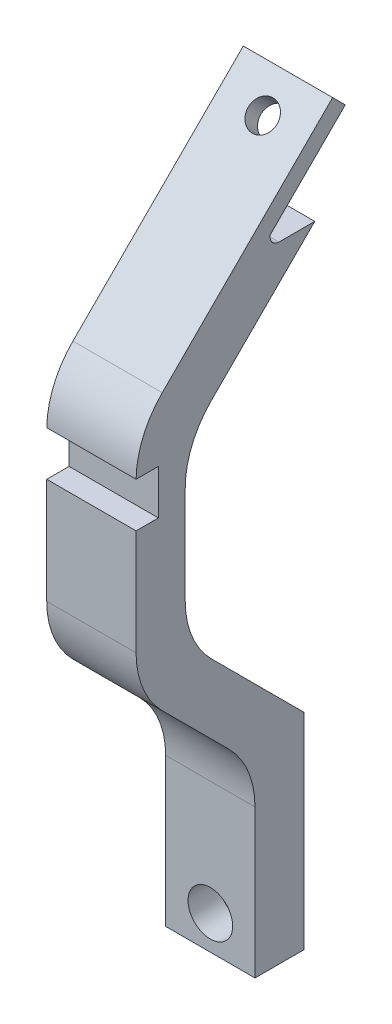
ISO-10303-21;
HEADER;
FILE_DESCRIPTION(('STEP AP214'),'2;1');
FILE_NAME('part.step','',(''),(''),'','','');
FILE_SCHEMA(('AUTOMOTIVE_DESIGN { 1 0 10303 214 1 1 1 1 }'));
ENDSEC;
DATA;
#1=APPLICATION_CONTEXT('core data for automotive mechanical design processes');
#2=APPLICATION_PROTOCOL_DEFINITION('international standard','automotive_design',2000,#1);
#3=PRODUCT_CONTEXT('',#1,'mechanical');
#4=PRODUCT('Part','Part','',(#3));
#5=PRODUCT_RELATED_PRODUCT_CATEGORY('part','',(#4));
#6=PRODUCT_DEFINITION_FORMATION('','',#4);
#7=PRODUCT_DEFINITION_CONTEXT('part definition',#1,'design');
#8=PRODUCT_DEFINITION('design','',#6,#7);
#9=PRODUCT_DEFINITION_SHAPE('','',#8);
#10=(LENGTH_UNIT() NAMED_UNIT(*) SI_UNIT(.MILLI.,.METRE.));
#11=(NAMED_UNIT(*) PLANE_ANGLE_UNIT() SI_UNIT($,.RADIAN.));
#12=(NAMED_UNIT(*) SI_UNIT($,.STERADIAN.) SOLID_ANGLE_UNIT());
#13=UNCERTAINTY_MEASURE_WITH_UNIT(LENGTH_MEASURE(1.E-05),#10,'distance_accuracy_value','');
#14=(GEOMETRIC_REPRESENTATION_CONTEXT(3) GLOBAL_UNCERTAINTY_ASSIGNED_CONTEXT((#13)) GLOBAL_UNIT_ASSIGNED_CONTEXT((#10,
#11,#12)) REPRESENTATION_CONTEXT('',''));
#15=CARTESIAN_POINT('',(0.,0.,0.));
#16=DIRECTION('',(0.,0.,1.));
#17=DIRECTION('',(1.,0.,0.));
#18=AXIS2_PLACEMENT_3D('',#15,#16,#17);
#19=CARTESIAN_POINT('',(0.,92.7234748115211,16.5857864376261));
#20=DIRECTION('',(0.,0.,1.));
#21=DIRECTION('',(1.,0.,0.));
#22=AXIS2_PLACEMENT_3D('',#19,#20,#21);
#23=CYLINDRICAL_SURFACE('',#22,1.625);
#24=CARTESIAN_POINT('',(0.,92.7234748115211,21.1884572681199));
#25=DIRECTION('',(0.,0.,1.));
#26=DIRECTION('',(0.,-1.,0.));
#27=AXIS2_PLACEMENT_3D('',#24,#25,#26);
#28=CIRCLE('',#27,1.625);
#29=CARTESIAN_POINT('',(0.,91.0984748115211,21.1884572681199));
#30=VERTEX_POINT('',#29);
#31=EDGE_CURVE('E228',#30,#30,#28,.T.);
#32=ORIENTED_EDGE('',*,*,#31,.F.);
#33=EDGE_LOOP('',(#32));
#34=FACE_BOUND('',#33,.T.);
#35=CARTESIAN_POINT('',(0.,92.7234748115211,23.1884572681199));
#36=DIRECTION('',(0.,0.,1.));
#37=DIRECTION('',(1.,0.,0.));
#38=AXIS2_PLACEMENT_3D('',#35,#36,#37);
#39=CIRCLE('',#38,1.625);
#40=CARTESIAN_POINT('',(1.625,92.7234748115211,23.1884572681199));
#41=VERTEX_POINT('',#40);
#42=EDGE_CURVE('E225',#41,#41,#39,.F.);
#43=ORIENTED_EDGE('',*,*,#42,.F.);
#44=EDGE_LOOP('',(#43));
#45=FACE_BOUND('',#44,.T.);
#46=ADVANCED_FACE('F32',(#34,#45),#23,.F.);
#47=CARTESIAN_POINT('',(5.,111.944905660377,21.1884572681199));
#48=DIRECTION('',(0.,0.,1.));
#49=DIRECTION('',(0.,-1.,0.));
#50=AXIS2_PLACEMENT_3D('',#47,#48,#49);
#51=PLANE('',#50);
#52=ORIENTED_EDGE('',*,*,#31,.T.);
#53=EDGE_LOOP('',(#52));
#54=FACE_BOUND('',#53,.T.);
#55=DIRECTION('',(0.,1.,0.));
#56=VECTOR('',#55,1.);
#57=CARTESIAN_POINT('',(-5.,111.944905660377,21.1884572681199));
#58=LINE('',#57,#56);
#59=CARTESIAN_POINT('',(-5.,88.9449056603774,21.1884572681199));
#60=VERTEX_POINT('',#59);
#61=CARTESIAN_POINT('',(-5.,111.944905660377,21.1884572681199));
#62=VERTEX_POINT('',#61);
#63=EDGE_CURVE('E231',#60,#62,#58,.T.);
#64=ORIENTED_EDGE('',*,*,#63,.T.);
#65=DIRECTION('',(-1.,0.,0.));
#66=VECTOR('',#65,1.);
#67=CARTESIAN_POINT('',(5.,111.944905660377,21.1884572681199));
#68=LINE('',#67,#66);
#69=CARTESIAN_POINT('',(5.,111.944905660377,21.1884572681199));
#70=VERTEX_POINT('',#69);
#71=EDGE_CURVE('E310',#70,#62,#68,.T.);
#72=ORIENTED_EDGE('',*,*,#71,.F.);
#73=DIRECTION('',(0.,1.,0.));
#74=VECTOR('',#73,1.);
#75=CARTESIAN_POINT('',(5.,111.944905660377,21.1884572681199));
#76=LINE('',#75,#74);
#77=CARTESIAN_POINT('',(5.,88.9449056603774,21.1884572681199));
#78=VERTEX_POINT('',#77);
#79=EDGE_CURVE('E232',#78,#70,#76,.T.);
#80=ORIENTED_EDGE('',*,*,#79,.F.);
#81=DIRECTION('',(-1.,0.,0.));
#82=VECTOR('',#81,1.);
#83=CARTESIAN_POINT('',(5.,88.9449056603774,21.1884572681199));
#84=LINE('',#83,#82);
#85=EDGE_CURVE('E263',#78,#60,#84,.T.);
#86=ORIENTED_EDGE('',*,*,#85,.T.);
#87=EDGE_LOOP('',(#64,#72,#80,#86));
#88=FACE_BOUND('',#87,.T.);
#89=ADVANCED_FACE('F394',(#54,#88),#51,.F.);
#90=CARTESIAN_POINT('',(5.,125.256448392256,34.4999999999991));
#91=DIRECTION('',(0.,-0.707106781186553,0.707106781186542));
#92=DIRECTION('',(0.,-0.707106781186542,-0.707106781186553));
#93=AXIS2_PLACEMENT_3D('',#90,#91,#92);
#94=PLANE('',#93);
#95=DIRECTION('',(0.,0.707106781186542,0.707106781186553));
#96=VECTOR('',#95,1.);
#97=CARTESIAN_POINT('',(-5.,125.256448392256,34.4999999999991));
#98=LINE('',#97,#96);
#99=CARTESIAN_POINT('',(-5.,122.327516204122,31.5710678118645));
#100=VERTEX_POINT('',#99);
#101=EDGE_CURVE('E266',#62,#100,#98,.T.);
#102=ORIENTED_EDGE('',*,*,#101,.T.);
#103=DIRECTION('',(-1.,0.,0.));
#104=VECTOR('',#103,1.);
#105=CARTESIAN_POINT('',(5.,122.327516204122,31.5710678118645));
#106=LINE('',#105,#104);
#107=CARTESIAN_POINT('',(5.,122.327516204122,31.5710678118645));
#108=VERTEX_POINT('',#107);
#109=EDGE_CURVE('E336',#100,#108,#106,.F.);
#110=ORIENTED_EDGE('',*,*,#109,.T.);
#111=DIRECTION('',(0.,0.707106781186542,0.707106781186553));
#112=VECTOR('',#111,1.);
#113=CARTESIAN_POINT('',(5.,125.256448392256,34.4999999999991));
#114=LINE('',#113,#112);
#115=EDGE_CURVE('E235',#70,#108,#114,.T.);
#116=ORIENTED_EDGE('',*,*,#115,.F.);
#117=ORIENTED_EDGE('',*,*,#71,.T.);
#118=EDGE_LOOP('',(#102,#110,#116,#117));
#119=FACE_BOUND('',#118,.T.);
#120=ADVANCED_FACE('F400',(#119),#94,.F.);
#121=CARTESIAN_POINT('',(5.,144.444905660377,34.4999999999991));
#122=DIRECTION('',(0.,0.,1.));
#123=DIRECTION('',(1.,0.,0.));
#124=AXIS2_PLACEMENT_3D('',#121,#122,#123);
#125=PLANE('',#124);
#126=DIRECTION('',(0.,1.,0.));
#127=VECTOR('',#126,1.);
#128=CARTESIAN_POINT('',(-5.,144.444905660377,34.4999999999991));
#129=LINE('',#128,#127);
#130=CARTESIAN_POINT('',(-5.,129.398584015987,34.4999999999991));
#131=VERTEX_POINT('',#130);
#132=CARTESIAN_POINT('',(-5.,140.302770036646,34.4999999999991));
#133=VERTEX_POINT('',#132);
#134=EDGE_CURVE('E269',#131,#133,#129,.T.);
#135=ORIENTED_EDGE('',*,*,#134,.T.);
#136=DIRECTION('',(-1.,0.,0.));
#137=VECTOR('',#136,1.);
#138=CARTESIAN_POINT('',(5.,140.302770036646,34.4999999999991));
#139=LINE('',#138,#137);
#140=CARTESIAN_POINT('',(5.,140.302770036646,34.4999999999991));
#141=VERTEX_POINT('',#140);
#142=EDGE_CURVE('E334',#133,#141,#139,.F.);
#143=ORIENTED_EDGE('',*,*,#142,.T.);
#144=DIRECTION('',(0.,1.,0.));
#145=VECTOR('',#144,1.);
#146=CARTESIAN_POINT('',(5.,144.444905660377,34.4999999999991));
#147=LINE('',#146,#145);
#148=CARTESIAN_POINT('',(5.,129.398584015987,34.4999999999991));
#149=VERTEX_POINT('',#148);
#150=EDGE_CURVE('E239',#149,#141,#147,.T.);
#151=ORIENTED_EDGE('',*,*,#150,.F.);
#152=DIRECTION('',(-1.,0.,0.));
#153=VECTOR('',#152,1.);
#154=CARTESIAN_POINT('',(-5.,129.398584015987,34.4999999999991));
#155=LINE('',#154,#153);
#156=EDGE_CURVE('E331',#149,#131,#155,.T.);
#157=ORIENTED_EDGE('',*,*,#156,.T.);
#158=EDGE_LOOP('',(#135,#143,#151,#157));
#159=FACE_BOUND('',#158,.T.);
#160=ADVANCED_FACE('F447',(#159),#125,.F.);
#161=CARTESIAN_POINT('',(5.,158.944905660377,19.9999999999993));
#162=DIRECTION('',(0.,0.707106781186537,0.707106781186558));
#163=DIRECTION('',(0.,-0.707106781186558,0.707106781186537));
#164=AXIS2_PLACEMENT_3D('',#161,#162,#163);
#165=PLANE('',#164);
#166=DIRECTION('',(0.,0.707106781186558,-0.707106781186537));
#167=VECTOR('',#166,1.);
#168=CARTESIAN_POINT('',(5.,158.944905660377,19.9999999999993));
#169=LINE('',#168,#167);
#170=CARTESIAN_POINT('',(5.,147.373837848512,31.5710678118646));
#171=VERTEX_POINT('',#170);
#172=CARTESIAN_POINT('',(5.,158.944905660377,19.9999999999993));
#173=VERTEX_POINT('',#172);
#174=EDGE_CURVE('E242',#171,#173,#169,.T.);
#175=ORIENTED_EDGE('',*,*,#174,.F.);
#176=DIRECTION('',(-1.,0.,0.));
#177=VECTOR('',#176,1.);
#178=CARTESIAN_POINT('',(-5.,147.373837848512,31.5710678118646));
#179=LINE('',#178,#177);
#180=CARTESIAN_POINT('',(-5.,147.373837848512,31.5710678118646));
#181=VERTEX_POINT('',#180);
#182=EDGE_CURVE('E328',#171,#181,#179,.T.);
#183=ORIENTED_EDGE('',*,*,#182,.T.);
#184=DIRECTION('',(0.,0.707106781186558,-0.707106781186537));
#185=VECTOR('',#184,1.);
#186=CARTESIAN_POINT('',(-5.,158.944905660377,19.9999999999993));
#187=LINE('',#186,#185);
#188=CARTESIAN_POINT('',(-5.,158.944905660377,19.9999999999993));
#189=VERTEX_POINT('',#188);
#190=EDGE_CURVE('E272',#181,#189,#187,.T.);
#191=ORIENTED_EDGE('',*,*,#190,.T.);
#192=DIRECTION('',(-1.,0.,0.));
#193=VECTOR('',#192,1.);
#194=CARTESIAN_POINT('',(5.,158.944905660377,19.9999999999993));
#195=LINE('',#194,#193);
#196=EDGE_CURVE('E307',#173,#189,#195,.T.);
#197=ORIENTED_EDGE('',*,*,#196,.F.);
#198=EDGE_LOOP('',(#175,#183,#191,#197));
#199=FACE_BOUND('',#198,.T.);
#200=ADVANCED_FACE('F444',(#199),#165,.F.);
#201=CARTESIAN_POINT('',(5.,158.944905660377,24.9999999999993));
#202=DIRECTION('',(0.,-1.,0.));
#203=DIRECTION('',(0.,0.,-1.));
#204=AXIS2_PLACEMENT_3D('',#201,#202,#203);
#205=PLANE('',#204);
#206=DIRECTION('',(0.,0.,1.));
#207=VECTOR('',#206,1.);
#208=CARTESIAN_POINT('',(-5.,158.944905660377,24.9999999999993));
#209=LINE('',#208,#207);
#210=CARTESIAN_POINT('',(-5.,158.944905660377,23.9999999999991));
#211=VERTEX_POINT('',#210);
#212=EDGE_CURVE('E274',#189,#211,#209,.T.);
#213=ORIENTED_EDGE('',*,*,#212,.T.);
#214=DIRECTION('',(-1.,0.,0.));
#215=VECTOR('',#214,1.);
#216=CARTESIAN_POINT('',(5.,158.944905660377,23.9999999999991));
#217=LINE('',#216,#215);
#218=CARTESIAN_POINT('',(5.,158.944905660377,23.9999999999991));
#219=VERTEX_POINT('',#218);
#220=EDGE_CURVE('E47',#211,#219,#217,.F.);
#221=ORIENTED_EDGE('',*,*,#220,.T.);
#222=DIRECTION('',(0.,0.,1.));
#223=VECTOR('',#222,1.);
#224=CARTESIAN_POINT('',(5.,158.944905660377,24.9999999999993));
#225=LINE('',#224,#223);
#226=EDGE_CURVE('E244',#173,#219,#225,.T.);
#227=ORIENTED_EDGE('',*,*,#226,.F.);
#228=ORIENTED_EDGE('',*,*,#196,.T.);
#229=EDGE_LOOP('',(#213,#221,#227,#228));
#230=FACE_BOUND('',#229,.T.);
#231=ADVANCED_FACE('F441',(#230),#205,.F.);
#232=CARTESIAN_POINT('',(5.,158.944905660377,24.9999999999993));
#233=DIRECTION('',(0.,1.89526925396711E-13,1.));
#234=DIRECTION('',(0.,-1.,1.89526925396711E-13));
#235=AXIS2_PLACEMENT_3D('',#232,#233,#234);
#236=PLANE('',#235);
#237=DIRECTION('',(0.,1.,-1.89526925396711E-13));
#238=VECTOR('',#237,1.);
#239=CARTESIAN_POINT('',(5.,158.944905660377,24.9999999999993));
#240=LINE('',#239,#238);
#241=CARTESIAN_POINT('',(5.,159.944905660378,24.9999999999991));
#242=VERTEX_POINT('',#241);
#243=CARTESIAN_POINT('',(5.,160.116478535631,24.9999999999991));
#244=VERTEX_POINT('',#243);
#245=EDGE_CURVE('E246',#242,#244,#240,.T.);
#246=ORIENTED_EDGE('',*,*,#245,.F.);
#247=DIRECTION('',(-1.,0.,0.));
#248=VECTOR('',#247,1.);
#249=CARTESIAN_POINT('',(-5.,159.944905660378,24.9999999999991));
#250=LINE('',#249,#248);
#251=CARTESIAN_POINT('',(-5.,159.944905660378,24.9999999999991));
#252=VERTEX_POINT('',#251);
#253=EDGE_CURVE('E360',#242,#252,#250,.T.);
#254=ORIENTED_EDGE('',*,*,#253,.T.);
#255=DIRECTION('',(0.,1.,-1.89526925396711E-13));
#256=VECTOR('',#255,1.);
#257=CARTESIAN_POINT('',(-5.,158.944905660377,24.9999999999993));
#258=LINE('',#257,#256);
#259=CARTESIAN_POINT('',(-5.,160.116478535631,24.9999999999991));
#260=VERTEX_POINT('',#259);
#261=EDGE_CURVE('E276',#252,#260,#258,.T.);
#262=ORIENTED_EDGE('',*,*,#261,.T.);
#263=DIRECTION('',(-1.,0.,0.));
#264=VECTOR('',#263,1.);
#265=CARTESIAN_POINT('',(5.,160.116478535631,24.9999999999991));
#266=LINE('',#265,#264);
#267=EDGE_CURVE('E304',#244,#260,#266,.T.);
#268=ORIENTED_EDGE('',*,*,#267,.F.);
#269=EDGE_LOOP('',(#246,#254,#262,#268));
#270=FACE_BOUND('',#269,.T.);
#271=ADVANCED_FACE('F366',(#270),#236,.F.);
#272=CARTESIAN_POINT('',(5.,160.116478535631,24.9999999999991));
#273=DIRECTION('',(0.,0.707106781186542,0.707106781186553));
#274=DIRECTION('',(0.,-0.707106781186553,0.707106781186542));
#275=AXIS2_PLACEMENT_3D('',#272,#273,#274);
#276=PLANE('',#275);
#277=CARTESIAN_POINT('',(0.,165.702264973258,19.4142135623722));
#278=DIRECTION('',(0.,0.707106781186542,0.707106781186553));
#279=DIRECTION('',(0.,-0.707106781186553,0.707106781186542));
#280=AXIS2_PLACEMENT_3D('',#277,#278,#279);
#281=CIRCLE('',#280,1.625);
#282=CARTESIAN_POINT('',(0.,164.55321645383,20.5632620818003));
#283=VERTEX_POINT('',#282);
#284=EDGE_CURVE('E211',#283,#283,#281,.T.);
#285=ORIENTED_EDGE('',*,*,#284,.T.);
#286=EDGE_LOOP('',(#285));
#287=FACE_BOUND('',#286,.T.);
#288=DIRECTION('',(0.,0.707106781186553,-0.707106781186542));
#289=VECTOR('',#288,1.);
#290=CARTESIAN_POINT('',(-5.,160.116478535631,24.9999999999991));
#291=LINE('',#290,#289);
#292=CARTESIAN_POINT('',(-5.,168.530692098004,16.5857864376261));
#293=VERTEX_POINT('',#292);
#294=EDGE_CURVE('E278',#260,#293,#291,.T.);
#295=ORIENTED_EDGE('',*,*,#294,.T.);
#296=DIRECTION('',(-1.,0.,0.));
#297=VECTOR('',#296,1.);
#298=CARTESIAN_POINT('',(5.,168.530692098004,16.5857864376261));
#299=LINE('',#298,#297);
#300=CARTESIAN_POINT('',(5.,168.530692098004,16.5857864376261));
#301=VERTEX_POINT('',#300);
#302=EDGE_CURVE('E301',#301,#293,#299,.T.);
#303=ORIENTED_EDGE('',*,*,#302,.F.);
#304=DIRECTION('',(0.,0.707106781186553,-0.707106781186542));
#305=VECTOR('',#304,1.);
#306=CARTESIAN_POINT('',(5.,160.116478535631,24.9999999999991));
#307=LINE('',#306,#305);
#308=EDGE_CURVE('E248',#244,#301,#307,.T.);
#309=ORIENTED_EDGE('',*,*,#308,.F.);
#310=ORIENTED_EDGE('',*,*,#267,.T.);
#311=EDGE_LOOP('',(#295,#303,#309,#310));
#312=FACE_BOUND('',#311,.T.);
#313=ADVANCED_FACE('F377',(#287,#312),#276,.F.);
#314=CARTESIAN_POINT('',(5.,168.530692098004,16.5857864376261));
#315=DIRECTION('',(0.,-0.707106781186541,0.707106781186554));
#316=DIRECTION('',(0.,-0.707106781186554,-0.707106781186541));
#317=AXIS2_PLACEMENT_3D('',#314,#315,#316);
#318=PLANE('',#317);
#319=DIRECTION('',(0.,0.707106781186554,0.707106781186541));
#320=VECTOR('',#319,1.);
#321=CARTESIAN_POINT('',(-5.,168.530692098004,16.5857864376261));
#322=LINE('',#321,#320);
#323=CARTESIAN_POINT('',(-5.,169.944905660377,17.9999999999991));
#324=VERTEX_POINT('',#323);
#325=EDGE_CURVE('E280',#293,#324,#322,.T.);
#326=ORIENTED_EDGE('',*,*,#325,.T.);
#327=DIRECTION('',(-1.,0.,0.));
#328=VECTOR('',#327,1.);
#329=CARTESIAN_POINT('',(5.,169.944905660377,17.9999999999991));
#330=LINE('',#329,#328);
#331=CARTESIAN_POINT('',(5.,169.944905660377,17.9999999999991));
#332=VERTEX_POINT('',#331);
#333=EDGE_CURVE('E298',#332,#324,#330,.T.);
#334=ORIENTED_EDGE('',*,*,#333,.F.);
#335=DIRECTION('',(0.,0.707106781186554,0.707106781186541));
#336=VECTOR('',#335,1.);
#337=CARTESIAN_POINT('',(5.,168.530692098004,16.5857864376261));
#338=LINE('',#337,#336);
#339=EDGE_CURVE('E250',#301,#332,#338,.T.);
#340=ORIENTED_EDGE('',*,*,#339,.F.);
#341=ORIENTED_EDGE('',*,*,#302,.T.);
#342=EDGE_LOOP('',(#326,#334,#340,#341));
#343=FACE_BOUND('',#342,.T.);
#344=ADVANCED_FACE('F381',(#343),#318,.F.);
#345=CARTESIAN_POINT('',(5.,147.944905660377,39.9999999999991));
#346=DIRECTION('',(0.,-0.707106781186542,-0.707106781186553));
#347=DIRECTION('',(0.,0.707106781186553,-0.707106781186542));
#348=AXIS2_PLACEMENT_3D('',#345,#346,#347);
#349=PLANE('',#348);
#350=CARTESIAN_POINT('',(0.,167.116478535631,20.8284271247453));
#351=DIRECTION('',(0.,0.707106781186542,0.707106781186553));
#352=DIRECTION('',(0.,-0.707106781186553,0.707106781186542));
#353=AXIS2_PLACEMENT_3D('',#350,#351,#352);
#354=CIRCLE('',#353,1.625);
#355=CARTESIAN_POINT('',(0.,165.967430016203,21.9774756441734));
#356=VERTEX_POINT('',#355);
#357=EDGE_CURVE('E690',#356,#356,#354,.T.);
#358=ORIENTED_EDGE('',*,*,#357,.F.);
#359=EDGE_LOOP('',(#358));
#360=FACE_BOUND('',#359,.T.);
#361=DIRECTION('',(0.,-0.707106781186553,0.707106781186542));
#362=VECTOR('',#361,1.);
#363=CARTESIAN_POINT('',(-5.,147.944905660377,39.9999999999991));
#364=LINE('',#363,#362);
#365=CARTESIAN_POINT('',(-5.,150.873837848512,37.0710678118646));
#366=VERTEX_POINT('',#365);
#367=EDGE_CURVE('E282',#324,#366,#364,.T.);
#368=ORIENTED_EDGE('',*,*,#367,.T.);
#369=DIRECTION('',(-1.,0.,0.));
#370=VECTOR('',#369,1.);
#371=CARTESIAN_POINT('',(5.,150.873837848512,37.0710678118646));
#372=LINE('',#371,#370);
#373=CARTESIAN_POINT('',(5.,150.873837848512,37.0710678118646));
#374=VERTEX_POINT('',#373);
#375=EDGE_CURVE('E323',#366,#374,#372,.F.);
#376=ORIENTED_EDGE('',*,*,#375,.T.);
#377=DIRECTION('',(0.,-0.707106781186553,0.707106781186542));
#378=VECTOR('',#377,1.);
#379=CARTESIAN_POINT('',(5.,147.944905660377,39.9999999999991));
#380=LINE('',#379,#378);
#381=EDGE_CURVE('E252',#332,#374,#380,.T.);
#382=ORIENTED_EDGE('',*,*,#381,.F.);
#383=ORIENTED_EDGE('',*,*,#333,.T.);
#384=EDGE_LOOP('',(#368,#376,#382,#383));
#385=FACE_BOUND('',#384,.T.);
#386=ADVANCED_FACE('F429',(#360,#385),#349,.F.);
#387=CARTESIAN_POINT('',(5.,122.978273799204,39.9999999999991));
#388=DIRECTION('',(0.,0.,-1.));
#389=DIRECTION('',(-1.,0.,0.));
#390=AXIS2_PLACEMENT_3D('',#387,#388,#389);
#391=PLANE('',#390);
#392=DIRECTION('',(0.,-1.,0.));
#393=VECTOR('',#392,1.);
#394=CARTESIAN_POINT('',(5.,122.978273799204,39.9999999999991));
#395=LINE('',#394,#393);
#396=CARTESIAN_POINT('',(5.,138.944905660377,40.));
#397=VERTEX_POINT('',#396);
#398=CARTESIAN_POINT('',(5.,127.120409422935,39.9999999999991));
#399=VERTEX_POINT('',#398);
#400=EDGE_CURVE('E254',#397,#399,#395,.T.);
#401=ORIENTED_EDGE('',*,*,#400,.F.);
#402=DIRECTION('',(-1.,0.,0.));
#403=VECTOR('',#402,1.);
#404=CARTESIAN_POINT('',(5.,138.944905660377,40.));
#405=LINE('',#404,#403);
#406=CARTESIAN_POINT('',(-5.,138.944905660377,40.));
#407=VERTEX_POINT('',#406);
#408=EDGE_CURVE('E217',#397,#407,#405,.T.);
#409=ORIENTED_EDGE('',*,*,#408,.T.);
#410=DIRECTION('',(0.,-1.,0.));
#411=VECTOR('',#410,1.);
#412=CARTESIAN_POINT('',(-5.,122.978273799204,39.9999999999991));
#413=LINE('',#412,#411);
#414=CARTESIAN_POINT('',(-5.,127.120409422935,39.9999999999991));
#415=VERTEX_POINT('',#414);
#416=EDGE_CURVE('E285',#407,#415,#413,.T.);
#417=ORIENTED_EDGE('',*,*,#416,.T.);
#418=DIRECTION('',(-1.,0.,0.));
#419=VECTOR('',#418,1.);
#420=CARTESIAN_POINT('',(5.,127.120409422935,39.9999999999991));
#421=LINE('',#420,#419);
#422=EDGE_CURVE('E313',#415,#399,#421,.F.);
#423=ORIENTED_EDGE('',*,*,#422,.T.);
#424=EDGE_LOOP('',(#401,#409,#417,#423));
#425=FACE_BOUND('',#424,.T.);
#426=ADVANCED_FACE('F425',(#425),#391,.F.);
#427=CARTESIAN_POINT('',(5.,109.666731067325,26.6884572681199));
#428=DIRECTION('',(0.,0.707106781186553,-0.707106781186542));
#429=DIRECTION('',(0.,0.707106781186542,0.707106781186553));
#430=AXIS2_PLACEMENT_3D('',#427,#428,#429);
#431=PLANE('',#430);
#432=DIRECTION('',(0.,-0.707106781186542,-0.707106781186553));
#433=VECTOR('',#432,1.);
#434=CARTESIAN_POINT('',(5.,109.666731067325,26.6884572681199));
#435=LINE('',#434,#433);
#436=CARTESIAN_POINT('',(5.,120.04934161107,37.0710678118645));
#437=VERTEX_POINT('',#436);
#438=CARTESIAN_POINT('',(5.,112.59566325546,29.6173894562544));
#439=VERTEX_POINT('',#438);
#440=EDGE_CURVE('E256',#437,#439,#435,.T.);
#441=ORIENTED_EDGE('',*,*,#440,.F.);
#442=DIRECTION('',(-1.,0.,0.));
#443=VECTOR('',#442,1.);
#444=CARTESIAN_POINT('',(5.,120.04934161107,37.0710678118645));
#445=LINE('',#444,#443);
#446=CARTESIAN_POINT('',(-5.,120.04934161107,37.0710678118645));
#447=VERTEX_POINT('',#446);
#448=EDGE_CURVE('E340',#437,#447,#445,.T.);
#449=ORIENTED_EDGE('',*,*,#448,.T.);
#450=DIRECTION('',(0.,-0.707106781186542,-0.707106781186553));
#451=VECTOR('',#450,1.);
#452=CARTESIAN_POINT('',(-5.,109.666731067325,26.6884572681199));
#453=LINE('',#452,#451);
#454=CARTESIAN_POINT('',(-5.,112.59566325546,29.6173894562544));
#455=VERTEX_POINT('',#454);
#456=EDGE_CURVE('E287',#447,#455,#453,.T.);
#457=ORIENTED_EDGE('',*,*,#456,.T.);
#458=DIRECTION('',(-1.,0.,0.));
#459=VECTOR('',#458,1.);
#460=CARTESIAN_POINT('',(5.,112.59566325546,29.6173894562544));
#461=LINE('',#460,#459);
#462=EDGE_CURVE('E338',#455,#439,#461,.F.);
#463=ORIENTED_EDGE('',*,*,#462,.T.);
#464=EDGE_LOOP('',(#441,#449,#457,#463));
#465=FACE_BOUND('',#464,.T.);
#466=ADVANCED_FACE('F421',(#465),#431,.F.);
#467=CARTESIAN_POINT('',(5.,88.9449056603774,26.6884572681199));
#468=DIRECTION('',(0.,0.,-1.));
#469=DIRECTION('',(-1.,0.,0.));
#470=AXIS2_PLACEMENT_3D('',#467,#468,#469);
#471=PLANE('',#470);
#472=CARTESIAN_POINT('',(0.,92.7234748115211,26.6884572681199));
#473=DIRECTION('',(0.,0.,1.));
#474=DIRECTION('',(1.,0.,0.));
#475=AXIS2_PLACEMENT_3D('',#472,#473,#474);
#476=CIRCLE('',#475,2.5);
#477=CARTESIAN_POINT('',(2.5,92.7234748115211,26.6884572681199));
#478=VERTEX_POINT('',#477);
#479=EDGE_CURVE('E220',#478,#478,#476,.T.);
#480=ORIENTED_EDGE('',*,*,#479,.F.);
#481=EDGE_LOOP('',(#480));
#482=FACE_BOUND('',#481,.T.);
#483=DIRECTION('',(0.,-1.,0.));
#484=VECTOR('',#483,1.);
#485=CARTESIAN_POINT('',(5.,88.9449056603774,26.6884572681199));
#486=LINE('',#485,#484);
#487=CARTESIAN_POINT('',(5.,105.524595443594,26.6884572681199));
#488=VERTEX_POINT('',#487);
#489=CARTESIAN_POINT('',(5.,88.9449056603774,26.6884572681199));
#490=VERTEX_POINT('',#489);
#491=EDGE_CURVE('E259',#488,#490,#486,.T.);
#492=ORIENTED_EDGE('',*,*,#491,.F.);
#493=DIRECTION('',(-1.,0.,0.));
#494=VECTOR('',#493,1.);
#495=CARTESIAN_POINT('',(-5.,105.524595443594,26.6884572681199));
#496=LINE('',#495,#494);
#497=CARTESIAN_POINT('',(-5.,105.524595443594,26.6884572681199));
#498=VERTEX_POINT('',#497);
#499=EDGE_CURVE('E343',#488,#498,#496,.T.);
#500=ORIENTED_EDGE('',*,*,#499,.T.);
#501=DIRECTION('',(0.,-1.,0.));
#502=VECTOR('',#501,1.);
#503=CARTESIAN_POINT('',(-5.,88.9449056603774,26.6884572681199));
#504=LINE('',#503,#502);
#505=CARTESIAN_POINT('',(-5.,88.9449056603774,26.6884572681199));
#506=VERTEX_POINT('',#505);
#507=EDGE_CURVE('E290',#498,#506,#504,.T.);
#508=ORIENTED_EDGE('',*,*,#507,.T.);
#509=DIRECTION('',(-1.,0.,0.));
#510=VECTOR('',#509,1.);
#511=CARTESIAN_POINT('',(5.,88.9449056603774,26.6884572681199));
#512=LINE('',#511,#510);
#513=EDGE_CURVE('E295',#490,#506,#512,.T.);
#514=ORIENTED_EDGE('',*,*,#513,.F.);
#515=EDGE_LOOP('',(#492,#500,#508,#514));
#516=FACE_BOUND('',#515,.T.);
#517=ADVANCED_FACE('F417',(#482,#516),#471,.F.);
#518=CARTESIAN_POINT('',(5.,88.9449056603774,21.1884572681199));
#519=DIRECTION('',(0.,1.,0.));
#520=DIRECTION('',(0.,0.,1.));
#521=AXIS2_PLACEMENT_3D('',#518,#519,#520);
#522=PLANE('',#521);
#523=DIRECTION('',(0.,0.,-1.));
#524=VECTOR('',#523,1.);
#525=CARTESIAN_POINT('',(-5.,88.9449056603774,21.1884572681199));
#526=LINE('',#525,#524);
#527=EDGE_CURVE('E236',#506,#60,#526,.T.);
#528=ORIENTED_EDGE('',*,*,#527,.T.);
#529=ORIENTED_EDGE('',*,*,#85,.F.);
#530=DIRECTION('',(0.,0.,-1.));
#531=VECTOR('',#530,1.);
#532=CARTESIAN_POINT('',(5.,88.9449056603774,21.1884572681199));
#533=LINE('',#532,#531);
#534=EDGE_CURVE('E261',#490,#78,#533,.T.);
#535=ORIENTED_EDGE('',*,*,#534,.F.);
#536=ORIENTED_EDGE('',*,*,#513,.T.);
#537=EDGE_LOOP('',(#528,#529,#535,#536));
#538=FACE_BOUND('',#537,.T.);
#539=ADVANCED_FACE('F411',(#538),#522,.F.);
#540=CARTESIAN_POINT('',(5.,0.,0.));
#541=DIRECTION('',(-1.,0.,0.));
#542=DIRECTION('',(0.,0.,1.));
#543=AXIS2_PLACEMENT_3D('',#540,#541,#542);
#544=PLANE('',#543);
#545=DIRECTION('',(0.,-1.,0.));
#546=VECTOR('',#545,1.);
#547=CARTESIAN_POINT('',(5.,143.944905660377,37.5));
#548=LINE('',#547,#546);
#549=CARTESIAN_POINT('',(5.,143.944905660377,37.5));
#550=VERTEX_POINT('',#549);
#551=CARTESIAN_POINT('',(5.,138.944905660377,37.5));
#552=VERTEX_POINT('',#551);
#553=EDGE_CURVE('E195',#550,#552,#548,.T.);
#554=ORIENTED_EDGE('',*,*,#553,.T.);
#555=DIRECTION('',(0.,0.,1.));
#556=VECTOR('',#555,1.);
#557=CARTESIAN_POINT('',(5.,138.944905660377,40.));
#558=LINE('',#557,#556);
#559=EDGE_CURVE('E192',#552,#397,#558,.T.);
#560=ORIENTED_EDGE('',*,*,#559,.T.);
#561=ORIENTED_EDGE('',*,*,#400,.T.);
#562=CARTESIAN_POINT('',(5.,127.120409422935,29.9999999999991));
#563=DIRECTION('',(-1.,0.,0.));
#564=DIRECTION('',(0.,0.,1.));
#565=AXIS2_PLACEMENT_3D('',#562,#563,#564);
#566=CIRCLE('',#565,10.);
#567=EDGE_CURVE('E325',#399,#437,#566,.F.);
#568=ORIENTED_EDGE('',*,*,#567,.T.);
#569=ORIENTED_EDGE('',*,*,#440,.T.);
#570=CARTESIAN_POINT('',(5.,105.524595443594,36.6884572681199));
#571=DIRECTION('',(-1.,0.,0.));
#572=DIRECTION('',(0.,0.,1.));
#573=AXIS2_PLACEMENT_3D('',#570,#571,#572);
#574=CIRCLE('',#573,10.);
#575=EDGE_CURVE('E356',#439,#488,#574,.T.);
#576=ORIENTED_EDGE('',*,*,#575,.T.);
#577=ORIENTED_EDGE('',*,*,#491,.T.);
#578=ORIENTED_EDGE('',*,*,#534,.T.);
#579=ORIENTED_EDGE('',*,*,#79,.T.);
#580=ORIENTED_EDGE('',*,*,#115,.T.);
#581=CARTESIAN_POINT('',(5.,129.398584015987,24.4999999999991));
#582=DIRECTION('',(-1.,0.,0.));
#583=DIRECTION('',(0.,0.,1.));
#584=AXIS2_PLACEMENT_3D('',#581,#582,#583);
#585=CIRCLE('',#584,10.);
#586=EDGE_CURVE('E352',#108,#149,#585,.T.);
#587=ORIENTED_EDGE('',*,*,#586,.T.);
#588=ORIENTED_EDGE('',*,*,#150,.T.);
#589=CARTESIAN_POINT('',(5.,140.302770036646,24.4999999999991));
#590=DIRECTION('',(-1.,0.,0.));
#591=DIRECTION('',(0.,0.,1.));
#592=AXIS2_PLACEMENT_3D('',#589,#590,#591);
#593=CIRCLE('',#592,10.);
#594=EDGE_CURVE('E348',#141,#171,#593,.T.);
#595=ORIENTED_EDGE('',*,*,#594,.T.);
#596=ORIENTED_EDGE('',*,*,#174,.T.);
#597=ORIENTED_EDGE('',*,*,#226,.T.);
#598=CARTESIAN_POINT('',(5.,159.944905660377,23.9999999999991));
#599=DIRECTION('',(-1.,0.,0.));
#600=DIRECTION('',(0.,0.,1.));
#601=AXIS2_PLACEMENT_3D('',#598,#599,#600);
#602=CIRCLE('',#601,1.);
#603=EDGE_CURVE('E11',#219,#242,#602,.T.);
#604=ORIENTED_EDGE('',*,*,#603,.T.);
#605=ORIENTED_EDGE('',*,*,#245,.T.);
#606=ORIENTED_EDGE('',*,*,#308,.T.);
#607=ORIENTED_EDGE('',*,*,#339,.T.);
#608=ORIENTED_EDGE('',*,*,#381,.T.);
#609=CARTESIAN_POINT('',(5.,143.802770036646,29.9999999999991));
#610=DIRECTION('',(-1.,0.,0.));
#611=DIRECTION('',(0.,0.,1.));
#612=AXIS2_PLACEMENT_3D('',#609,#610,#611);
#613=CIRCLE('',#612,10.);
#614=CARTESIAN_POINT('',(5.,143.944905660377,39.9989898221994));
#615=VERTEX_POINT('',#614);
#616=EDGE_CURVE('E205',#374,#615,#613,.F.);
#617=ORIENTED_EDGE('',*,*,#616,.T.);
#618=DIRECTION('',(0.,0.,-1.));
#619=VECTOR('',#618,1.);
#620=CARTESIAN_POINT('',(5.,143.944905660377,40.));
#621=LINE('',#620,#619);
#622=EDGE_CURVE('E184',#615,#550,#621,.T.);
#623=ORIENTED_EDGE('',*,*,#622,.T.);
#624=EDGE_LOOP('',(#554,#560,#561,#568,#569,#576,#577,#578,#579,#580,#587,#588,#595,#596,#597,
#604,#605,#606,#607,#608,#617,#623));
#625=FACE_BOUND('',#624,.T.);
#626=ADVANCED_FACE('F202',(#625),#544,.F.);
#627=CARTESIAN_POINT('',(-5.,0.,0.));
#628=DIRECTION('',(-1.,0.,0.));
#629=DIRECTION('',(0.,0.,1.));
#630=AXIS2_PLACEMENT_3D('',#627,#628,#629);
#631=PLANE('',#630);
#632=DIRECTION('',(0.,0.,1.));
#633=VECTOR('',#632,1.);
#634=CARTESIAN_POINT('',(-5.,138.944905660377,40.));
#635=LINE('',#634,#633);
#636=CARTESIAN_POINT('',(-5.,138.944905660377,37.5));
#637=VERTEX_POINT('',#636);
#638=EDGE_CURVE('E206',#637,#407,#635,.T.);
#639=ORIENTED_EDGE('',*,*,#638,.F.);
#640=DIRECTION('',(0.,-1.,0.));
#641=VECTOR('',#640,1.);
#642=CARTESIAN_POINT('',(-5.,143.944905660377,37.5));
#643=LINE('',#642,#641);
#644=CARTESIAN_POINT('',(-5.,143.944905660377,37.5));
#645=VERTEX_POINT('',#644);
#646=EDGE_CURVE('E208',#645,#637,#643,.T.);
#647=ORIENTED_EDGE('',*,*,#646,.F.);
#648=DIRECTION('',(0.,0.,-1.));
#649=VECTOR('',#648,1.);
#650=CARTESIAN_POINT('',(-5.,143.944905660377,40.));
#651=LINE('',#650,#649);
#652=CARTESIAN_POINT('',(-5.,143.944905660377,39.9989898221994));
#653=VERTEX_POINT('',#652);
#654=EDGE_CURVE('E187',#653,#645,#651,.T.);
#655=ORIENTED_EDGE('',*,*,#654,.F.);
#656=CARTESIAN_POINT('',(-5.,143.802770036646,29.9999999999991));
#657=DIRECTION('',(-1.,0.,0.));
#658=DIRECTION('',(0.,0.,1.));
#659=AXIS2_PLACEMENT_3D('',#656,#657,#658);
#660=CIRCLE('',#659,10.);
#661=EDGE_CURVE('E321',#653,#366,#660,.T.);
#662=ORIENTED_EDGE('',*,*,#661,.T.);
#663=ORIENTED_EDGE('',*,*,#367,.F.);
#664=ORIENTED_EDGE('',*,*,#325,.F.);
#665=ORIENTED_EDGE('',*,*,#294,.F.);
#666=ORIENTED_EDGE('',*,*,#261,.F.);
#667=CARTESIAN_POINT('',(-5.,159.944905660377,23.9999999999991));
#668=DIRECTION('',(-1.,0.,0.));
#669=DIRECTION('',(0.,0.,1.));
#670=AXIS2_PLACEMENT_3D('',#667,#668,#669);
#671=CIRCLE('',#670,1.);
#672=EDGE_CURVE('E40',#252,#211,#671,.F.);
#673=ORIENTED_EDGE('',*,*,#672,.T.);
#674=ORIENTED_EDGE('',*,*,#212,.F.);
#675=ORIENTED_EDGE('',*,*,#190,.F.);
#676=CARTESIAN_POINT('',(-5.,140.302770036646,24.4999999999991));
#677=DIRECTION('',(-1.,0.,0.));
#678=DIRECTION('',(0.,0.,1.));
#679=AXIS2_PLACEMENT_3D('',#676,#677,#678);
#680=CIRCLE('',#679,10.);
#681=EDGE_CURVE('E346',#181,#133,#680,.F.);
#682=ORIENTED_EDGE('',*,*,#681,.T.);
#683=ORIENTED_EDGE('',*,*,#134,.F.);
#684=CARTESIAN_POINT('',(-5.,129.398584015987,24.4999999999991));
#685=DIRECTION('',(-1.,0.,0.));
#686=DIRECTION('',(0.,0.,1.));
#687=AXIS2_PLACEMENT_3D('',#684,#685,#686);
#688=CIRCLE('',#687,10.);
#689=EDGE_CURVE('E350',#131,#100,#688,.F.);
#690=ORIENTED_EDGE('',*,*,#689,.T.);
#691=ORIENTED_EDGE('',*,*,#101,.F.);
#692=ORIENTED_EDGE('',*,*,#63,.F.);
#693=ORIENTED_EDGE('',*,*,#527,.F.);
#694=ORIENTED_EDGE('',*,*,#507,.F.);
#695=CARTESIAN_POINT('',(-5.,105.524595443594,36.6884572681199));
#696=DIRECTION('',(-1.,0.,0.));
#697=DIRECTION('',(0.,0.,1.));
#698=AXIS2_PLACEMENT_3D('',#695,#696,#697);
#699=CIRCLE('',#698,10.);
#700=EDGE_CURVE('E354',#498,#455,#699,.F.);
#701=ORIENTED_EDGE('',*,*,#700,.T.);
#702=ORIENTED_EDGE('',*,*,#456,.F.);
#703=CARTESIAN_POINT('',(-5.,127.120409422935,29.9999999999991));
#704=DIRECTION('',(-1.,0.,0.));
#705=DIRECTION('',(0.,0.,1.));
#706=AXIS2_PLACEMENT_3D('',#703,#704,#705);
#707=CIRCLE('',#706,10.);
#708=EDGE_CURVE('E318',#447,#415,#707,.T.);
#709=ORIENTED_EDGE('',*,*,#708,.T.);
#710=ORIENTED_EDGE('',*,*,#416,.F.);
#711=EDGE_LOOP('',(#639,#647,#655,#662,#663,#664,#665,#666,#673,#674,#675,#682,#683,#690,#691,
#692,#693,#694,#701,#702,#709,#710));
#712=FACE_BOUND('',#711,.T.);
#713=ADVANCED_FACE('F372',(#712),#631,.T.);
#714=CARTESIAN_POINT('',(0.,92.7234748115211,23.1884572681199));
#715=DIRECTION('',(0.,0.,1.));
#716=DIRECTION('',(1.,0.,0.));
#717=AXIS2_PLACEMENT_3D('',#714,#715,#716);
#718=PLANE('',#717);
#719=CARTESIAN_POINT('',(0.,92.7234748115211,23.1884572681199));
#720=DIRECTION('',(0.,0.,1.));
#721=DIRECTION('',(1.,0.,0.));
#722=AXIS2_PLACEMENT_3D('',#719,#720,#721);
#723=CIRCLE('',#722,2.5);
#724=CARTESIAN_POINT('',(2.5,92.7234748115211,23.1884572681199));
#725=VERTEX_POINT('',#724);
#726=EDGE_CURVE('E222',#725,#725,#723,.T.);
#727=ORIENTED_EDGE('',*,*,#726,.T.);
#728=EDGE_LOOP('',(#727));
#729=FACE_BOUND('',#728,.T.);
#730=ORIENTED_EDGE('',*,*,#42,.T.);
#731=EDGE_LOOP('',(#730));
#732=FACE_BOUND('',#731,.T.);
#733=ADVANCED_FACE('F414',(#729,#732),#718,.T.);
#734=CARTESIAN_POINT('',(0.,92.7234748115211,23.1884572681199));
#735=DIRECTION('',(0.,0.,1.));
#736=DIRECTION('',(1.,0.,0.));
#737=AXIS2_PLACEMENT_3D('',#734,#735,#736);
#738=CYLINDRICAL_SURFACE('',#737,2.5);
#739=ORIENTED_EDGE('',*,*,#726,.F.);
#740=EDGE_LOOP('',(#739));
#741=FACE_BOUND('',#740,.T.);
#742=ORIENTED_EDGE('',*,*,#479,.T.);
#743=EDGE_LOOP('',(#742));
#744=FACE_BOUND('',#743,.T.);
#745=ADVANCED_FACE('F407',(#741,#744),#738,.F.);
#746=CARTESIAN_POINT('',(5.,143.802770036646,29.9999999999991));
#747=DIRECTION('',(-1.,0.,0.));
#748=DIRECTION('',(0.,0.,1.));
#749=AXIS2_PLACEMENT_3D('',#746,#747,#748);
#750=CYLINDRICAL_SURFACE('',#749,10.);
#751=DIRECTION('',(-1.,0.,0.));
#752=VECTOR('',#751,1.);
#753=CARTESIAN_POINT('',(5.,143.944905660377,39.9989898221994));
#754=LINE('',#753,#752);
#755=EDGE_CURVE('E358',#615,#653,#754,.T.);
#756=ORIENTED_EDGE('',*,*,#755,.F.);
#757=ORIENTED_EDGE('',*,*,#616,.F.);
#758=ORIENTED_EDGE('',*,*,#375,.F.);
#759=ORIENTED_EDGE('',*,*,#661,.F.);
#760=EDGE_LOOP('',(#756,#757,#758,#759));
#761=FACE_BOUND('',#760,.T.);
#762=ADVANCED_FACE('F455',(#761),#750,.T.);
#763=CARTESIAN_POINT('',(5.,140.302770036646,24.4999999999991));
#764=DIRECTION('',(1.,0.,0.));
#765=DIRECTION('',(0.,0.,-1.));
#766=AXIS2_PLACEMENT_3D('',#763,#764,#765);
#767=CYLINDRICAL_SURFACE('',#766,10.);
#768=ORIENTED_EDGE('',*,*,#594,.F.);
#769=ORIENTED_EDGE('',*,*,#142,.F.);
#770=ORIENTED_EDGE('',*,*,#681,.F.);
#771=ORIENTED_EDGE('',*,*,#182,.F.);
#772=EDGE_LOOP('',(#768,#769,#770,#771));
#773=FACE_BOUND('',#772,.T.);
#774=ADVANCED_FACE('F458',(#773),#767,.F.);
#775=CARTESIAN_POINT('',(5.,129.398584015987,24.4999999999991));
#776=DIRECTION('',(1.,0.,0.));
#777=DIRECTION('',(0.,0.,-1.));
#778=AXIS2_PLACEMENT_3D('',#775,#776,#777);
#779=CYLINDRICAL_SURFACE('',#778,10.);
#780=ORIENTED_EDGE('',*,*,#586,.F.);
#781=ORIENTED_EDGE('',*,*,#109,.F.);
#782=ORIENTED_EDGE('',*,*,#689,.F.);
#783=ORIENTED_EDGE('',*,*,#156,.F.);
#784=EDGE_LOOP('',(#780,#781,#782,#783));
#785=FACE_BOUND('',#784,.T.);
#786=ADVANCED_FACE('F462',(#785),#779,.F.);
#787=CARTESIAN_POINT('',(5.,127.120409422935,29.9999999999991));
#788=DIRECTION('',(-1.,0.,0.));
#789=DIRECTION('',(0.,0.,1.));
#790=AXIS2_PLACEMENT_3D('',#787,#788,#789);
#791=CYLINDRICAL_SURFACE('',#790,10.);
#792=ORIENTED_EDGE('',*,*,#567,.F.);
#793=ORIENTED_EDGE('',*,*,#422,.F.);
#794=ORIENTED_EDGE('',*,*,#708,.F.);
#795=ORIENTED_EDGE('',*,*,#448,.F.);
#796=EDGE_LOOP('',(#792,#793,#794,#795));
#797=FACE_BOUND('',#796,.T.);
#798=ADVANCED_FACE('F466',(#797),#791,.T.);
#799=CARTESIAN_POINT('',(5.,105.524595443594,36.6884572681199));
#800=DIRECTION('',(1.,0.,0.));
#801=DIRECTION('',(0.,0.,-1.));
#802=AXIS2_PLACEMENT_3D('',#799,#800,#801);
#803=CYLINDRICAL_SURFACE('',#802,10.);
#804=ORIENTED_EDGE('',*,*,#575,.F.);
#805=ORIENTED_EDGE('',*,*,#462,.F.);
#806=ORIENTED_EDGE('',*,*,#700,.F.);
#807=ORIENTED_EDGE('',*,*,#499,.F.);
#808=EDGE_LOOP('',(#804,#805,#806,#807));
#809=FACE_BOUND('',#808,.T.);
#810=ADVANCED_FACE('F469',(#809),#803,.F.);
#811=CARTESIAN_POINT('',(5.,138.944905660377,40.));
#812=DIRECTION('',(0.,-1.,0.));
#813=DIRECTION('',(0.,0.,-1.));
#814=AXIS2_PLACEMENT_3D('',#811,#812,#813);
#815=PLANE('',#814);
#816=ORIENTED_EDGE('',*,*,#638,.T.);
#817=ORIENTED_EDGE('',*,*,#408,.F.);
#818=ORIENTED_EDGE('',*,*,#559,.F.);
#819=DIRECTION('',(-1.,0.,0.));
#820=VECTOR('',#819,1.);
#821=CARTESIAN_POINT('',(5.,138.944905660377,37.5));
#822=LINE('',#821,#820);
#823=EDGE_CURVE('E191',#552,#637,#822,.T.);
#824=ORIENTED_EDGE('',*,*,#823,.T.);
#825=EDGE_LOOP('',(#816,#817,#818,#824));
#826=FACE_BOUND('',#825,.T.);
#827=ADVANCED_FACE('F472',(#826),#815,.F.);
#828=CARTESIAN_POINT('',(5.,143.944905660377,37.5));
#829=DIRECTION('',(0.,0.,-1.));
#830=DIRECTION('',(0.,1.,0.));
#831=AXIS2_PLACEMENT_3D('',#828,#829,#830);
#832=PLANE('',#831);
#833=ORIENTED_EDGE('',*,*,#646,.T.);
#834=ORIENTED_EDGE('',*,*,#823,.F.);
#835=ORIENTED_EDGE('',*,*,#553,.F.);
#836=DIRECTION('',(-1.,0.,0.));
#837=VECTOR('',#836,1.);
#838=CARTESIAN_POINT('',(5.,143.944905660377,37.5));
#839=LINE('',#838,#837);
#840=EDGE_CURVE('E180',#550,#645,#839,.T.);
#841=ORIENTED_EDGE('',*,*,#840,.T.);
#842=EDGE_LOOP('',(#833,#834,#835,#841));
#843=FACE_BOUND('',#842,.T.);
#844=ADVANCED_FACE('F196',(#843),#832,.F.);
#845=CARTESIAN_POINT('',(5.,143.944905660377,40.));
#846=DIRECTION('',(0.,1.,0.));
#847=DIRECTION('',(0.,0.,1.));
#848=AXIS2_PLACEMENT_3D('',#845,#846,#847);
#849=PLANE('',#848);
#850=ORIENTED_EDGE('',*,*,#755,.T.);
#851=ORIENTED_EDGE('',*,*,#654,.T.);
#852=ORIENTED_EDGE('',*,*,#840,.F.);
#853=ORIENTED_EDGE('',*,*,#622,.F.);
#854=EDGE_LOOP('',(#850,#851,#852,#853));
#855=FACE_BOUND('',#854,.T.);
#856=ADVANCED_FACE('F182',(#855),#849,.F.);
#857=CARTESIAN_POINT('',(5.,159.944905660377,23.9999999999991));
#858=DIRECTION('',(1.,0.,0.));
#859=DIRECTION('',(0.,0.,-1.));
#860=AXIS2_PLACEMENT_3D('',#857,#858,#859);
#861=CYLINDRICAL_SURFACE('',#860,1.);
#862=ORIENTED_EDGE('',*,*,#603,.F.);
#863=ORIENTED_EDGE('',*,*,#220,.F.);
#864=ORIENTED_EDGE('',*,*,#672,.F.);
#865=ORIENTED_EDGE('',*,*,#253,.F.);
#866=EDGE_LOOP('',(#862,#863,#864,#865));
#867=FACE_BOUND('',#866,.T.);
#868=ADVANCED_FACE('F34',(#867),#861,.F.);
#869=CARTESIAN_POINT('',(0.,160.045410723766,13.7573593128798));
#870=DIRECTION('',(0.,0.707106781186542,0.707106781186553));
#871=DIRECTION('',(0.,-0.707106781186553,0.707106781186542));
#872=AXIS2_PLACEMENT_3D('',#869,#870,#871);
#873=CYLINDRICAL_SURFACE('',#872,1.625);
#874=ORIENTED_EDGE('',*,*,#357,.T.);
#875=EDGE_LOOP('',(#874));
#876=FACE_BOUND('',#875,.T.);
#877=ORIENTED_EDGE('',*,*,#284,.F.);
#878=EDGE_LOOP('',(#877));
#879=FACE_BOUND('',#878,.T.);
#880=ADVANCED_FACE('F385',(#876,#879),#873,.F.);
#881=CLOSED_SHELL('',(#46,#89,#120,#160,#200,#231,#271,#313,#344,#386,#426,#466,#517,#539,#626,
#713,#733,#745,#762,#774,#786,#798,#810,#827,#844,#856,#868,#880));
#882=MANIFOLD_SOLID_BREP('B2',#881);
#883=ADVANCED_BREP_SHAPE_REPRESENTATION('',(#18,#882),#14);
#884=SHAPE_DEFINITION_REPRESENTATION(#9,#883);
ENDSEC;
END-ISO-10303-21;
